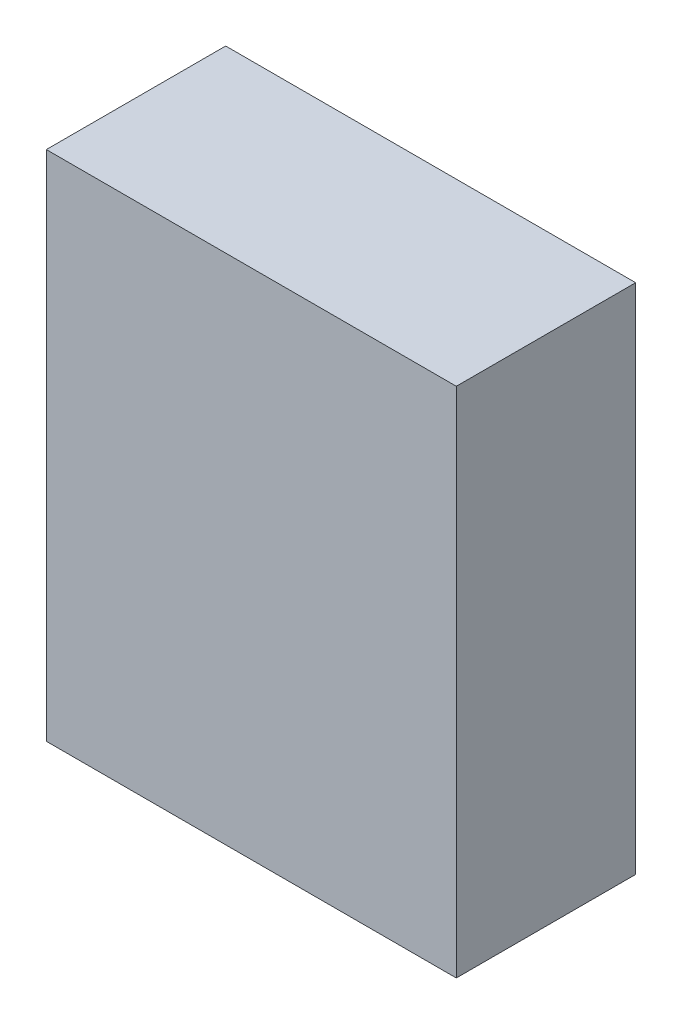
ISO-10303-21;
HEADER;
FILE_DESCRIPTION(('STEP AP214'),'2;1');
FILE_NAME('part.step','',(''),(''),'','','');
FILE_SCHEMA(('AUTOMOTIVE_DESIGN { 1 0 10303 214 1 1 1 1 }'));
ENDSEC;
DATA;
#1=APPLICATION_CONTEXT('core data for automotive mechanical design processes');
#2=APPLICATION_PROTOCOL_DEFINITION('international standard','automotive_design',2000,#1);
#3=PRODUCT_CONTEXT('',#1,'mechanical');
#4=PRODUCT('Part','Part','',(#3));
#5=PRODUCT_RELATED_PRODUCT_CATEGORY('part','',(#4));
#6=PRODUCT_DEFINITION_FORMATION('','',#4);
#7=PRODUCT_DEFINITION_CONTEXT('part definition',#1,'design');
#8=PRODUCT_DEFINITION('design','',#6,#7);
#9=PRODUCT_DEFINITION_SHAPE('','',#8);
#10=(LENGTH_UNIT() NAMED_UNIT(*) SI_UNIT(.MILLI.,.METRE.));
#11=(NAMED_UNIT(*) PLANE_ANGLE_UNIT() SI_UNIT($,.RADIAN.));
#12=(NAMED_UNIT(*) SI_UNIT($,.STERADIAN.) SOLID_ANGLE_UNIT());
#13=UNCERTAINTY_MEASURE_WITH_UNIT(LENGTH_MEASURE(1.E-05),#10,'distance_accuracy_value','');
#14=(GEOMETRIC_REPRESENTATION_CONTEXT(3) GLOBAL_UNCERTAINTY_ASSIGNED_CONTEXT((#13)) GLOBAL_UNIT_ASSIGNED_CONTEXT((#10,
#11,#12)) REPRESENTATION_CONTEXT('',''));
#15=CARTESIAN_POINT('',(0.,0.,0.));
#16=DIRECTION('',(0.,0.,1.));
#17=DIRECTION('',(1.,0.,0.));
#18=AXIS2_PLACEMENT_3D('',#15,#16,#17);
#19=CARTESIAN_POINT('',(-2.00000108,2.50000008,1.74999904));
#20=DIRECTION('',(0.,0.,-1.));
#21=DIRECTION('',(-1.,0.,0.));
#22=AXIS2_PLACEMENT_3D('',#19,#20,#21);
#23=PLANE('',#22);
#24=DIRECTION('',(1.,0.,0.));
#25=VECTOR('',#24,1.);
#26=CARTESIAN_POINT('',(-2.00000108,-2.50000008,1.74999904));
#27=LINE('',#26,#25);
#28=CARTESIAN_POINT('',(-2.00000108,-2.50000008,1.74999904));
#29=VERTEX_POINT('',#28);
#30=CARTESIAN_POINT('',(2.00000108,-2.50000008,1.74999904));
#31=VERTEX_POINT('',#30);
#32=EDGE_CURVE('E55',#29,#31,#27,.T.);
#33=ORIENTED_EDGE('',*,*,#32,.T.);
#34=DIRECTION('',(0.,1.,0.));
#35=VECTOR('',#34,1.);
#36=CARTESIAN_POINT('',(2.00000108,-2.50000008,1.74999904));
#37=LINE('',#36,#35);
#38=CARTESIAN_POINT('',(2.00000108,2.50000008,1.74999904));
#39=VERTEX_POINT('',#38);
#40=EDGE_CURVE('E57',#31,#39,#37,.T.);
#41=ORIENTED_EDGE('',*,*,#40,.T.);
#42=DIRECTION('',(1.,0.,0.));
#43=VECTOR('',#42,1.);
#44=CARTESIAN_POINT('',(2.00000108,2.50000008,1.74999904));
#45=LINE('',#44,#43);
#46=CARTESIAN_POINT('',(-2.00000108,2.50000008,1.74999904));
#47=VERTEX_POINT('',#46);
#48=EDGE_CURVE('E20',#39,#47,#45,.F.);
#49=ORIENTED_EDGE('',*,*,#48,.T.);
#50=DIRECTION('',(0.,1.,0.));
#51=VECTOR('',#50,1.);
#52=CARTESIAN_POINT('',(-2.00000108,2.50000008,1.74999904));
#53=LINE('',#52,#51);
#54=EDGE_CURVE('E80',#47,#29,#53,.F.);
#55=ORIENTED_EDGE('',*,*,#54,.T.);
#56=EDGE_LOOP('',(#33,#41,#49,#55));
#57=FACE_BOUND('',#56,.T.);
#58=ADVANCED_FACE('F17',(#57),#23,.F.);
#59=CARTESIAN_POINT('',(2.00000108,2.50000008,0.));
#60=DIRECTION('',(0.,-1.,0.));
#61=DIRECTION('',(0.,0.,-1.));
#62=AXIS2_PLACEMENT_3D('',#59,#60,#61);
#63=PLANE('',#62);
#64=DIRECTION('',(0.,0.,-1.));
#65=VECTOR('',#64,1.);
#66=CARTESIAN_POINT('',(-2.00000108,2.50000008,0.));
#67=LINE('',#66,#65);
#68=CARTESIAN_POINT('',(-2.00000108,2.50000008,0.));
#69=VERTEX_POINT('',#68);
#70=EDGE_CURVE('E68',#69,#47,#67,.F.);
#71=ORIENTED_EDGE('',*,*,#70,.T.);
#72=ORIENTED_EDGE('',*,*,#48,.F.);
#73=DIRECTION('',(0.,0.,1.));
#74=VECTOR('',#73,1.);
#75=CARTESIAN_POINT('',(2.00000108,2.50000008,0.));
#76=LINE('',#75,#74);
#77=CARTESIAN_POINT('',(2.00000108,2.50000008,0.));
#78=VERTEX_POINT('',#77);
#79=EDGE_CURVE('E63',#39,#78,#76,.F.);
#80=ORIENTED_EDGE('',*,*,#79,.T.);
#81=DIRECTION('',(-1.,0.,0.));
#82=VECTOR('',#81,1.);
#83=CARTESIAN_POINT('',(-2.00000108,2.50000008,0.));
#84=LINE('',#83,#82);
#85=EDGE_CURVE('E83',#69,#78,#84,.F.);
#86=ORIENTED_EDGE('',*,*,#85,.F.);
#87=EDGE_LOOP('',(#71,#72,#80,#86));
#88=FACE_BOUND('',#87,.T.);
#89=ADVANCED_FACE('F65',(#88),#63,.F.);
#90=CARTESIAN_POINT('',(2.00000108,-2.50000008,0.));
#91=DIRECTION('',(-1.,0.,0.));
#92=DIRECTION('',(0.,0.,1.));
#93=AXIS2_PLACEMENT_3D('',#90,#91,#92);
#94=PLANE('',#93);
#95=ORIENTED_EDGE('',*,*,#79,.F.);
#96=ORIENTED_EDGE('',*,*,#40,.F.);
#97=DIRECTION('',(0.,0.,1.));
#98=VECTOR('',#97,1.);
#99=CARTESIAN_POINT('',(2.00000108,-2.50000008,0.));
#100=LINE('',#99,#98);
#101=CARTESIAN_POINT('',(2.00000108,-2.50000008,0.));
#102=VERTEX_POINT('',#101);
#103=EDGE_CURVE('E75',#31,#102,#100,.F.);
#104=ORIENTED_EDGE('',*,*,#103,.T.);
#105=DIRECTION('',(0.,1.,0.));
#106=VECTOR('',#105,1.);
#107=CARTESIAN_POINT('',(2.00000108,2.50000008,0.));
#108=LINE('',#107,#106);
#109=EDGE_CURVE('E72',#78,#102,#108,.F.);
#110=ORIENTED_EDGE('',*,*,#109,.F.);
#111=EDGE_LOOP('',(#95,#96,#104,#110));
#112=FACE_BOUND('',#111,.T.);
#113=ADVANCED_FACE('F70',(#112),#94,.F.);
#114=CARTESIAN_POINT('',(-2.00000108,-2.50000008,0.));
#115=DIRECTION('',(0.,1.,0.));
#116=DIRECTION('',(0.,0.,1.));
#117=AXIS2_PLACEMENT_3D('',#114,#115,#116);
#118=PLANE('',#117);
#119=ORIENTED_EDGE('',*,*,#103,.F.);
#120=ORIENTED_EDGE('',*,*,#32,.F.);
#121=DIRECTION('',(0.,0.,-1.));
#122=VECTOR('',#121,1.);
#123=CARTESIAN_POINT('',(-2.00000108,-2.50000008,0.));
#124=LINE('',#123,#122);
#125=CARTESIAN_POINT('',(-2.00000108,-2.50000008,0.));
#126=VERTEX_POINT('',#125);
#127=EDGE_CURVE('E35',#29,#126,#124,.T.);
#128=ORIENTED_EDGE('',*,*,#127,.T.);
#129=DIRECTION('',(-1.,0.,0.));
#130=VECTOR('',#129,1.);
#131=CARTESIAN_POINT('',(-2.00000108,-2.50000008,0.));
#132=LINE('',#131,#130);
#133=EDGE_CURVE('E26',#102,#126,#132,.T.);
#134=ORIENTED_EDGE('',*,*,#133,.F.);
#135=EDGE_LOOP('',(#119,#120,#128,#134));
#136=FACE_BOUND('',#135,.T.);
#137=ADVANCED_FACE('F89',(#136),#118,.F.);
#138=CARTESIAN_POINT('',(-2.00000108,2.50000008,0.));
#139=DIRECTION('',(1.,0.,0.));
#140=DIRECTION('',(0.,0.,-1.));
#141=AXIS2_PLACEMENT_3D('',#138,#139,#140);
#142=PLANE('',#141);
#143=ORIENTED_EDGE('',*,*,#127,.F.);
#144=ORIENTED_EDGE('',*,*,#54,.F.);
#145=ORIENTED_EDGE('',*,*,#70,.F.);
#146=DIRECTION('',(0.,1.,0.));
#147=VECTOR('',#146,1.);
#148=CARTESIAN_POINT('',(-2.00000108,2.50000008,0.));
#149=LINE('',#148,#147);
#150=EDGE_CURVE('E11',#126,#69,#149,.T.);
#151=ORIENTED_EDGE('',*,*,#150,.F.);
#152=EDGE_LOOP('',(#143,#144,#145,#151));
#153=FACE_BOUND('',#152,.T.);
#154=ADVANCED_FACE('F91',(#153),#142,.F.);
#155=CARTESIAN_POINT('',(-2.00000108,2.50000008,0.));
#156=DIRECTION('',(0.,0.,-1.));
#157=DIRECTION('',(-1.,0.,0.));
#158=AXIS2_PLACEMENT_3D('',#155,#156,#157);
#159=PLANE('',#158);
#160=ORIENTED_EDGE('',*,*,#133,.T.);
#161=ORIENTED_EDGE('',*,*,#150,.T.);
#162=ORIENTED_EDGE('',*,*,#85,.T.);
#163=ORIENTED_EDGE('',*,*,#109,.T.);
#164=EDGE_LOOP('',(#160,#161,#162,#163));
#165=FACE_BOUND('',#164,.T.);
#166=ADVANCED_FACE('F88',(#165),#159,.T.);
#167=CLOSED_SHELL('',(#58,#89,#113,#137,#154,#166));
#168=MANIFOLD_SOLID_BREP('B1',#167);
#169=ADVANCED_BREP_SHAPE_REPRESENTATION('',(#18,#168),#14);
#170=SHAPE_DEFINITION_REPRESENTATION(#9,#169);
ENDSEC;
END-ISO-10303-21;
